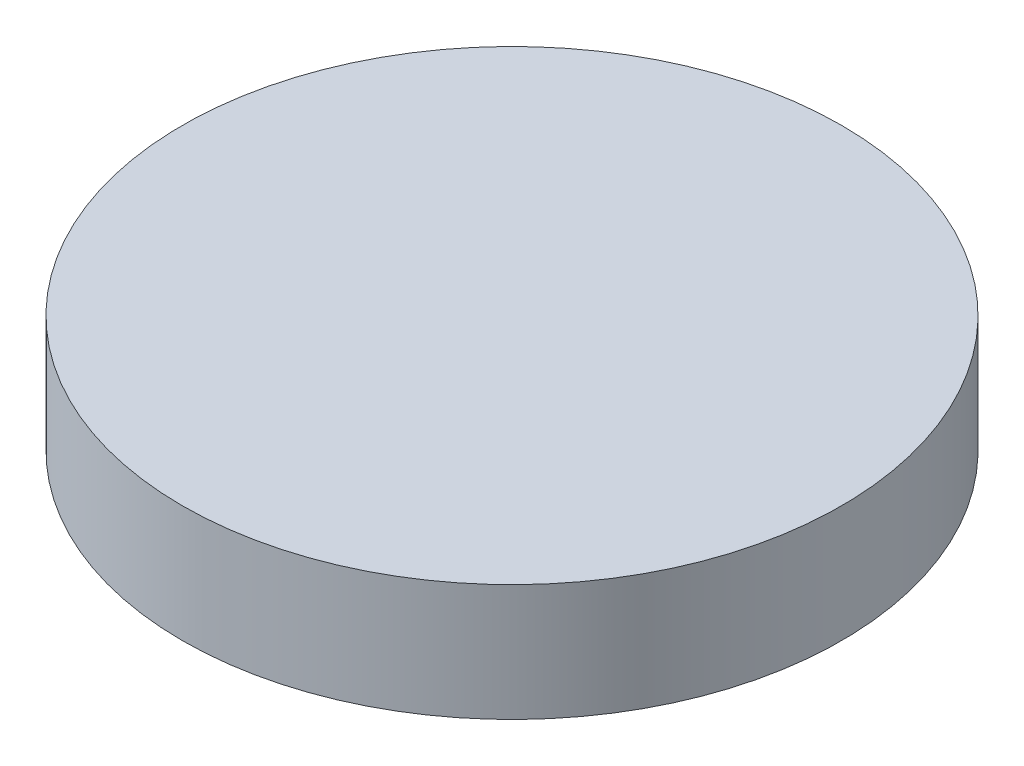
ISO-10303-21;
HEADER;
FILE_DESCRIPTION(('STEP AP214'),'2;1');
FILE_NAME('part.step','',(''),(''),'','','');
FILE_SCHEMA(('AUTOMOTIVE_DESIGN { 1 0 10303 214 1 1 1 1 }'));
ENDSEC;
DATA;
#1=APPLICATION_CONTEXT('core data for automotive mechanical design processes');
#2=APPLICATION_PROTOCOL_DEFINITION('international standard','automotive_design',2000,#1);
#3=PRODUCT_CONTEXT('',#1,'mechanical');
#4=PRODUCT('Part','Part','',(#3));
#5=PRODUCT_RELATED_PRODUCT_CATEGORY('part','',(#4));
#6=PRODUCT_DEFINITION_FORMATION('','',#4);
#7=PRODUCT_DEFINITION_CONTEXT('part definition',#1,'design');
#8=PRODUCT_DEFINITION('design','',#6,#7);
#9=PRODUCT_DEFINITION_SHAPE('','',#8);
#10=(LENGTH_UNIT() NAMED_UNIT(*) SI_UNIT(.MILLI.,.METRE.));
#11=(NAMED_UNIT(*) PLANE_ANGLE_UNIT() SI_UNIT($,.RADIAN.));
#12=(NAMED_UNIT(*) SI_UNIT($,.STERADIAN.) SOLID_ANGLE_UNIT());
#13=UNCERTAINTY_MEASURE_WITH_UNIT(LENGTH_MEASURE(1.E-05),#10,'distance_accuracy_value','');
#14=(GEOMETRIC_REPRESENTATION_CONTEXT(3) GLOBAL_UNCERTAINTY_ASSIGNED_CONTEXT((#13)) GLOBAL_UNIT_ASSIGNED_CONTEXT((#10,
#11,#12)) REPRESENTATION_CONTEXT('',''));
#15=CARTESIAN_POINT('',(0.,0.,0.));
#16=DIRECTION('',(0.,0.,1.));
#17=DIRECTION('',(1.,0.,0.));
#18=AXIS2_PLACEMENT_3D('',#15,#16,#17);
#19=CARTESIAN_POINT('',(0.,14.3,-5.95140074906367));
#20=DIRECTION('',(0.,-1.,0.));
#21=DIRECTION('',(0.,0.,-1.));
#22=AXIS2_PLACEMENT_3D('',#19,#20,#21);
#23=CYLINDRICAL_SURFACE('',#22,40.35);
#24=CARTESIAN_POINT('',(0.,14.3,-5.95140074906367));
#25=DIRECTION('',(0.,1.,0.));
#26=DIRECTION('',(0.,0.,1.));
#27=AXIS2_PLACEMENT_3D('',#24,#25,#26);
#28=CIRCLE('',#27,40.35);
#29=CARTESIAN_POINT('',(0.,14.3,34.3985992509363));
#30=VERTEX_POINT('',#29);
#31=EDGE_CURVE('E10',#30,#30,#28,.T.);
#32=ORIENTED_EDGE('',*,*,#31,.F.);
#33=EDGE_LOOP('',(#32));
#34=FACE_BOUND('',#33,.T.);
#35=CARTESIAN_POINT('',(0.,0.,-5.95140074906367));
#36=DIRECTION('',(0.,1.,0.));
#37=DIRECTION('',(0.,0.,1.));
#38=AXIS2_PLACEMENT_3D('',#35,#36,#37);
#39=CIRCLE('',#38,40.35);
#40=CARTESIAN_POINT('',(0.,0.,34.3985992509363));
#41=VERTEX_POINT('',#40);
#42=EDGE_CURVE('E40',#41,#41,#39,.T.);
#43=ORIENTED_EDGE('',*,*,#42,.T.);
#44=EDGE_LOOP('',(#43));
#45=FACE_BOUND('',#44,.T.);
#46=ADVANCED_FACE('F37',(#34,#45),#23,.T.);
#47=CARTESIAN_POINT('',(0.,14.3,-5.95140074906367));
#48=DIRECTION('',(0.,1.,0.));
#49=DIRECTION('',(0.,0.,1.));
#50=AXIS2_PLACEMENT_3D('',#47,#48,#49);
#51=PLANE('',#50);
#52=ORIENTED_EDGE('',*,*,#31,.T.);
#53=EDGE_LOOP('',(#52));
#54=FACE_BOUND('',#53,.T.);
#55=ADVANCED_FACE('F52',(#54),#51,.T.);
#56=CARTESIAN_POINT('',(0.,0.,-5.95140074906367));
#57=DIRECTION('',(0.,1.,0.));
#58=DIRECTION('',(0.,0.,1.));
#59=AXIS2_PLACEMENT_3D('',#56,#57,#58);
#60=PLANE('',#59);
#61=ORIENTED_EDGE('',*,*,#42,.F.);
#62=EDGE_LOOP('',(#61));
#63=FACE_BOUND('',#62,.T.);
#64=ADVANCED_FACE('F50',(#63),#60,.F.);
#65=CLOSED_SHELL('',(#46,#55,#64));
#66=MANIFOLD_SOLID_BREP('B2',#65);
#67=ADVANCED_BREP_SHAPE_REPRESENTATION('',(#18,#66),#14);
#68=SHAPE_DEFINITION_REPRESENTATION(#9,#67);
ENDSEC;
END-ISO-10303-21;
